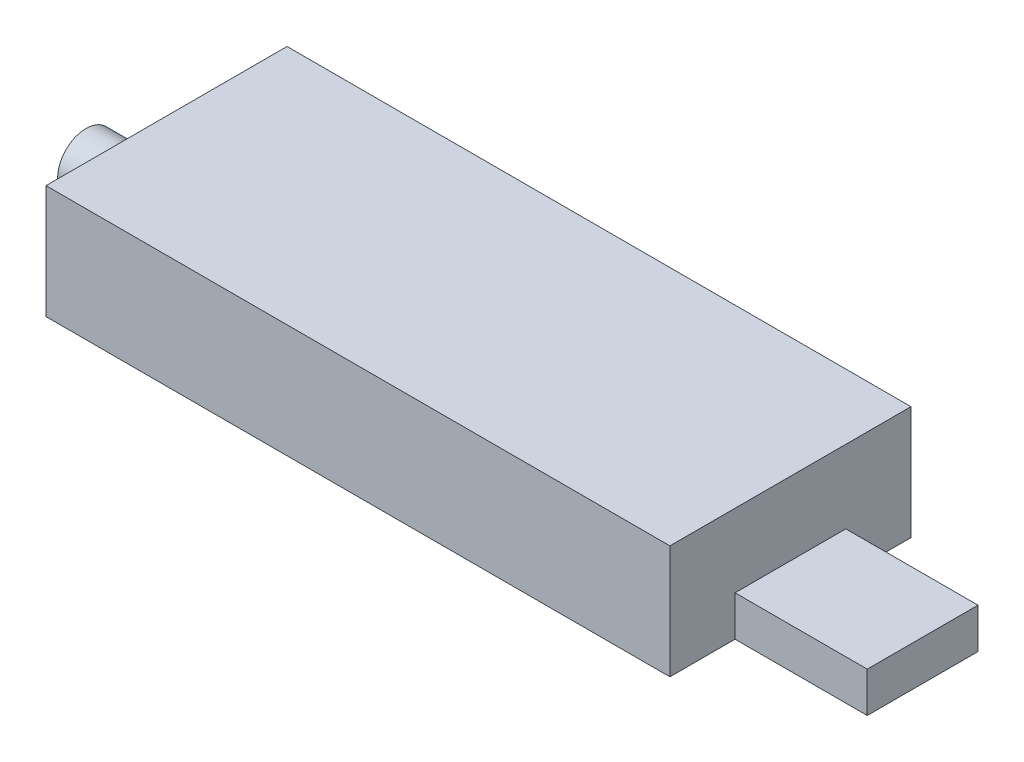
ISO-10303-21;
HEADER;
FILE_DESCRIPTION(('STEP AP214'),'2;1');
FILE_NAME('part.step','',(''),(''),'','','');
FILE_SCHEMA(('AUTOMOTIVE_DESIGN { 1 0 10303 214 1 1 1 1 }'));
ENDSEC;
DATA;
#1=APPLICATION_CONTEXT('core data for automotive mechanical design processes');
#2=APPLICATION_PROTOCOL_DEFINITION('international standard','automotive_design',2000,#1);
#3=PRODUCT_CONTEXT('',#1,'mechanical');
#4=PRODUCT('Part','Part','',(#3));
#5=PRODUCT_RELATED_PRODUCT_CATEGORY('part','',(#4));
#6=PRODUCT_DEFINITION_FORMATION('','',#4);
#7=PRODUCT_DEFINITION_CONTEXT('part definition',#1,'design');
#8=PRODUCT_DEFINITION('design','',#6,#7);
#9=PRODUCT_DEFINITION_SHAPE('','',#8);
#10=(LENGTH_UNIT() NAMED_UNIT(*) SI_UNIT(.MILLI.,.METRE.));
#11=(NAMED_UNIT(*) PLANE_ANGLE_UNIT() SI_UNIT($,.RADIAN.));
#12=(NAMED_UNIT(*) SI_UNIT($,.STERADIAN.) SOLID_ANGLE_UNIT());
#13=UNCERTAINTY_MEASURE_WITH_UNIT(LENGTH_MEASURE(1.E-05),#10,'distance_accuracy_value','');
#14=(GEOMETRIC_REPRESENTATION_CONTEXT(3) GLOBAL_UNCERTAINTY_ASSIGNED_CONTEXT((#13)) GLOBAL_UNIT_ASSIGNED_CONTEXT((#10,
#11,#12)) REPRESENTATION_CONTEXT('',''));
#15=CARTESIAN_POINT('',(0.,0.,0.));
#16=DIRECTION('',(0.,0.,1.));
#17=DIRECTION('',(1.,0.,0.));
#18=AXIS2_PLACEMENT_3D('',#15,#16,#17);
#19=CARTESIAN_POINT('',(69.85,12.7,0.));
#20=DIRECTION('',(-1.,0.,0.));
#21=DIRECTION('',(0.,0.,1.));
#22=AXIS2_PLACEMENT_3D('',#19,#20,#21);
#23=PLANE('',#22);
#24=DIRECTION('',(0.,-1.,0.));
#25=VECTOR('',#24,1.);
#26=CARTESIAN_POINT('',(69.85,0.,-7.29375));
#27=LINE('',#26,#25);
#28=CARTESIAN_POINT('',(69.85,4.5,-7.29375));
#29=VERTEX_POINT('',#28);
#30=CARTESIAN_POINT('',(69.85,0.,-7.29375));
#31=VERTEX_POINT('',#30);
#32=EDGE_CURVE('E51',#29,#31,#27,.T.);
#33=ORIENTED_EDGE('',*,*,#32,.F.);
#34=DIRECTION('',(0.,0.,1.));
#35=VECTOR('',#34,1.);
#36=CARTESIAN_POINT('',(69.85,4.5,-7.29375));
#37=LINE('',#36,#35);
#38=CARTESIAN_POINT('',(69.85,4.5,-19.69375));
#39=VERTEX_POINT('',#38);
#40=EDGE_CURVE('E121',#39,#29,#37,.T.);
#41=ORIENTED_EDGE('',*,*,#40,.F.);
#42=DIRECTION('',(0.,1.,0.));
#43=VECTOR('',#42,1.);
#44=CARTESIAN_POINT('',(69.85,0.,-19.69375));
#45=LINE('',#44,#43);
#46=CARTESIAN_POINT('',(69.85,0.,-19.69375));
#47=VERTEX_POINT('',#46);
#48=EDGE_CURVE('E57',#47,#39,#45,.T.);
#49=ORIENTED_EDGE('',*,*,#48,.F.);
#50=DIRECTION('',(0.,0.,-1.));
#51=VECTOR('',#50,1.);
#52=CARTESIAN_POINT('',(69.85,0.,0.));
#53=LINE('',#52,#51);
#54=CARTESIAN_POINT('',(69.85,0.,-26.9875));
#55=VERTEX_POINT('',#54);
#56=EDGE_CURVE('E145',#47,#55,#53,.T.);
#57=ORIENTED_EDGE('',*,*,#56,.T.);
#58=DIRECTION('',(0.,-1.,0.));
#59=VECTOR('',#58,1.);
#60=CARTESIAN_POINT('',(69.85,12.7,-26.9875));
#61=LINE('',#60,#59);
#62=CARTESIAN_POINT('',(69.85,12.7,-26.9875));
#63=VERTEX_POINT('',#62);
#64=EDGE_CURVE('E151',#63,#55,#61,.T.);
#65=ORIENTED_EDGE('',*,*,#64,.F.);
#66=DIRECTION('',(0.,0.,-1.));
#67=VECTOR('',#66,1.);
#68=CARTESIAN_POINT('',(69.85,12.7,0.));
#69=LINE('',#68,#67);
#70=CARTESIAN_POINT('',(69.85,12.7,0.));
#71=VERTEX_POINT('',#70);
#72=EDGE_CURVE('E139',#71,#63,#69,.T.);
#73=ORIENTED_EDGE('',*,*,#72,.F.);
#74=DIRECTION('',(0.,-1.,0.));
#75=VECTOR('',#74,1.);
#76=CARTESIAN_POINT('',(69.85,12.7,0.));
#77=LINE('',#76,#75);
#78=CARTESIAN_POINT('',(69.85,0.,0.));
#79=VERTEX_POINT('',#78);
#80=EDGE_CURVE('E154',#71,#79,#77,.T.);
#81=ORIENTED_EDGE('',*,*,#80,.T.);
#82=EDGE_CURVE('E146',#79,#31,#53,.T.);
#83=ORIENTED_EDGE('',*,*,#82,.T.);
#84=EDGE_LOOP('',(#33,#41,#49,#57,#65,#73,#81,#83));
#85=FACE_BOUND('',#84,.T.);
#86=ADVANCED_FACE('F36',(#85),#23,.F.);
#87=CARTESIAN_POINT('',(0.,12.7,0.));
#88=DIRECTION('',(1.,0.,0.));
#89=DIRECTION('',(0.,0.,-1.));
#90=AXIS2_PLACEMENT_3D('',#87,#88,#89);
#91=PLANE('',#90);
#92=CARTESIAN_POINT('',(0.,3.81,-13.49375));
#93=DIRECTION('',(1.,0.,0.));
#94=DIRECTION('',(0.,0.,-1.));
#95=AXIS2_PLACEMENT_3D('',#92,#93,#94);
#96=CIRCLE('',#95,3.175);
#97=CARTESIAN_POINT('',(0.,3.81,-16.66875));
#98=VERTEX_POINT('',#97);
#99=EDGE_CURVE('E11',#98,#98,#96,.F.);
#100=ORIENTED_EDGE('',*,*,#99,.F.);
#101=EDGE_LOOP('',(#100));
#102=FACE_BOUND('',#101,.T.);
#103=DIRECTION('',(0.,0.,1.));
#104=VECTOR('',#103,1.);
#105=CARTESIAN_POINT('',(0.,0.,0.));
#106=LINE('',#105,#104);
#107=CARTESIAN_POINT('',(0.,0.,-26.9875));
#108=VERTEX_POINT('',#107);
#109=CARTESIAN_POINT('',(0.,0.,0.));
#110=VERTEX_POINT('',#109);
#111=EDGE_CURVE('E124',#108,#110,#106,.T.);
#112=ORIENTED_EDGE('',*,*,#111,.T.);
#113=DIRECTION('',(0.,-1.,0.));
#114=VECTOR('',#113,1.);
#115=CARTESIAN_POINT('',(0.,12.7,0.));
#116=LINE('',#115,#114);
#117=CARTESIAN_POINT('',(0.,12.7,0.));
#118=VERTEX_POINT('',#117);
#119=EDGE_CURVE('E44',#118,#110,#116,.T.);
#120=ORIENTED_EDGE('',*,*,#119,.F.);
#121=DIRECTION('',(0.,0.,1.));
#122=VECTOR('',#121,1.);
#123=CARTESIAN_POINT('',(0.,12.7,0.));
#124=LINE('',#123,#122);
#125=CARTESIAN_POINT('',(0.,12.7,-26.9875));
#126=VERTEX_POINT('',#125);
#127=EDGE_CURVE('E133',#126,#118,#124,.T.);
#128=ORIENTED_EDGE('',*,*,#127,.F.);
#129=DIRECTION('',(0.,-1.,0.));
#130=VECTOR('',#129,1.);
#131=CARTESIAN_POINT('',(0.,12.7,-26.9875));
#132=LINE('',#131,#130);
#133=EDGE_CURVE('E142',#126,#108,#132,.T.);
#134=ORIENTED_EDGE('',*,*,#133,.T.);
#135=EDGE_LOOP('',(#112,#120,#128,#134));
#136=FACE_BOUND('',#135,.T.);
#137=ADVANCED_FACE('F38',(#102,#136),#91,.F.);
#138=CARTESIAN_POINT('',(0.,12.7,0.));
#139=DIRECTION('',(0.,0.,-1.));
#140=DIRECTION('',(-1.,0.,0.));
#141=AXIS2_PLACEMENT_3D('',#138,#139,#140);
#142=PLANE('',#141);
#143=DIRECTION('',(1.,0.,0.));
#144=VECTOR('',#143,1.);
#145=CARTESIAN_POINT('',(0.,0.,0.));
#146=LINE('',#145,#144);
#147=EDGE_CURVE('E127',#110,#79,#146,.T.);
#148=ORIENTED_EDGE('',*,*,#147,.T.);
#149=ORIENTED_EDGE('',*,*,#80,.F.);
#150=DIRECTION('',(1.,0.,0.));
#151=VECTOR('',#150,1.);
#152=CARTESIAN_POINT('',(0.,12.7,0.));
#153=LINE('',#152,#151);
#154=EDGE_CURVE('E136',#118,#71,#153,.T.);
#155=ORIENTED_EDGE('',*,*,#154,.F.);
#156=ORIENTED_EDGE('',*,*,#119,.T.);
#157=EDGE_LOOP('',(#148,#149,#155,#156));
#158=FACE_BOUND('',#157,.T.);
#159=ADVANCED_FACE('F159',(#158),#142,.F.);
#160=CARTESIAN_POINT('',(0.,12.7,-26.9875));
#161=DIRECTION('',(0.,0.,1.));
#162=DIRECTION('',(1.,0.,0.));
#163=AXIS2_PLACEMENT_3D('',#160,#161,#162);
#164=PLANE('',#163);
#165=DIRECTION('',(-1.,0.,0.));
#166=VECTOR('',#165,1.);
#167=CARTESIAN_POINT('',(0.,0.,-26.9875));
#168=LINE('',#167,#166);
#169=EDGE_CURVE('E137',#55,#108,#168,.T.);
#170=ORIENTED_EDGE('',*,*,#169,.T.);
#171=ORIENTED_EDGE('',*,*,#133,.F.);
#172=DIRECTION('',(-1.,0.,0.));
#173=VECTOR('',#172,1.);
#174=CARTESIAN_POINT('',(0.,12.7,-26.9875));
#175=LINE('',#174,#173);
#176=EDGE_CURVE('E141',#63,#126,#175,.T.);
#177=ORIENTED_EDGE('',*,*,#176,.F.);
#178=ORIENTED_EDGE('',*,*,#64,.T.);
#179=EDGE_LOOP('',(#170,#171,#177,#178));
#180=FACE_BOUND('',#179,.T.);
#181=ADVANCED_FACE('F171',(#180),#164,.F.);
#182=CARTESIAN_POINT('',(0.,12.7,0.));
#183=DIRECTION('',(0.,-1.,0.));
#184=DIRECTION('',(0.,0.,-1.));
#185=AXIS2_PLACEMENT_3D('',#182,#183,#184);
#186=PLANE('',#185);
#187=ORIENTED_EDGE('',*,*,#127,.T.);
#188=ORIENTED_EDGE('',*,*,#154,.T.);
#189=ORIENTED_EDGE('',*,*,#72,.T.);
#190=ORIENTED_EDGE('',*,*,#176,.T.);
#191=EDGE_LOOP('',(#187,#188,#189,#190));
#192=FACE_BOUND('',#191,.T.);
#193=ADVANCED_FACE('F169',(#192),#186,.F.);
#194=CARTESIAN_POINT('',(0.,0.,0.));
#195=DIRECTION('',(0.,-1.,0.));
#196=DIRECTION('',(0.,0.,-1.));
#197=AXIS2_PLACEMENT_3D('',#194,#195,#196);
#198=PLANE('',#197);
#199=ORIENTED_EDGE('',*,*,#111,.F.);
#200=ORIENTED_EDGE('',*,*,#169,.F.);
#201=ORIENTED_EDGE('',*,*,#56,.F.);
#202=DIRECTION('',(-1.,0.,0.));
#203=VECTOR('',#202,1.);
#204=CARTESIAN_POINT('',(84.65,0.,-19.69375));
#205=LINE('',#204,#203);
#206=CARTESIAN_POINT('',(84.65,0.,-19.69375));
#207=VERTEX_POINT('',#206);
#208=EDGE_CURVE('E108',#207,#47,#205,.T.);
#209=ORIENTED_EDGE('',*,*,#208,.F.);
#210=DIRECTION('',(0.,0.,-1.));
#211=VECTOR('',#210,1.);
#212=CARTESIAN_POINT('',(84.65,0.,-7.29375));
#213=LINE('',#212,#211);
#214=CARTESIAN_POINT('',(84.65,0.,-7.29375));
#215=VERTEX_POINT('',#214);
#216=EDGE_CURVE('E100',#215,#207,#213,.T.);
#217=ORIENTED_EDGE('',*,*,#216,.F.);
#218=DIRECTION('',(-1.,0.,0.));
#219=VECTOR('',#218,1.);
#220=CARTESIAN_POINT('',(84.65,0.,-7.29375));
#221=LINE('',#220,#219);
#222=EDGE_CURVE('E106',#215,#31,#221,.T.);
#223=ORIENTED_EDGE('',*,*,#222,.T.);
#224=ORIENTED_EDGE('',*,*,#82,.F.);
#225=ORIENTED_EDGE('',*,*,#147,.F.);
#226=EDGE_LOOP('',(#199,#200,#201,#209,#217,#223,#224,#225));
#227=FACE_BOUND('',#226,.T.);
#228=ADVANCED_FACE('F103',(#227),#198,.T.);
#229=CARTESIAN_POINT('',(84.65,0.,-7.29375));
#230=DIRECTION('',(0.,0.,-1.));
#231=DIRECTION('',(-1.,0.,0.));
#232=AXIS2_PLACEMENT_3D('',#229,#230,#231);
#233=PLANE('',#232);
#234=ORIENTED_EDGE('',*,*,#32,.T.);
#235=ORIENTED_EDGE('',*,*,#222,.F.);
#236=DIRECTION('',(0.,-1.,0.));
#237=VECTOR('',#236,1.);
#238=CARTESIAN_POINT('',(84.65,0.,-7.29375));
#239=LINE('',#238,#237);
#240=CARTESIAN_POINT('',(84.65,4.5,-7.29375));
#241=VERTEX_POINT('',#240);
#242=EDGE_CURVE('E112',#241,#215,#239,.T.);
#243=ORIENTED_EDGE('',*,*,#242,.F.);
#244=DIRECTION('',(-1.,0.,0.));
#245=VECTOR('',#244,1.);
#246=CARTESIAN_POINT('',(84.65,4.5,-7.29375));
#247=LINE('',#246,#245);
#248=EDGE_CURVE('E284',#241,#29,#247,.T.);
#249=ORIENTED_EDGE('',*,*,#248,.T.);
#250=EDGE_LOOP('',(#234,#235,#243,#249));
#251=FACE_BOUND('',#250,.T.);
#252=ADVANCED_FACE('F123',(#251),#233,.F.);
#253=CARTESIAN_POINT('',(84.65,0.,-19.69375));
#254=DIRECTION('',(0.,0.,1.));
#255=DIRECTION('',(0.,-1.,0.));
#256=AXIS2_PLACEMENT_3D('',#253,#254,#255);
#257=PLANE('',#256);
#258=ORIENTED_EDGE('',*,*,#48,.T.);
#259=DIRECTION('',(-1.,0.,0.));
#260=VECTOR('',#259,1.);
#261=CARTESIAN_POINT('',(84.65,4.5,-19.69375));
#262=LINE('',#261,#260);
#263=CARTESIAN_POINT('',(84.65,4.5,-19.69375));
#264=VERTEX_POINT('',#263);
#265=EDGE_CURVE('E129',#264,#39,#262,.T.);
#266=ORIENTED_EDGE('',*,*,#265,.F.);
#267=DIRECTION('',(0.,1.,0.));
#268=VECTOR('',#267,1.);
#269=CARTESIAN_POINT('',(84.65,0.,-19.69375));
#270=LINE('',#269,#268);
#271=EDGE_CURVE('E111',#207,#264,#270,.T.);
#272=ORIENTED_EDGE('',*,*,#271,.F.);
#273=ORIENTED_EDGE('',*,*,#208,.T.);
#274=EDGE_LOOP('',(#258,#266,#272,#273));
#275=FACE_BOUND('',#274,.T.);
#276=ADVANCED_FACE('F207',(#275),#257,.F.);
#277=CARTESIAN_POINT('',(84.65,4.5,-7.29375));
#278=DIRECTION('',(0.,-1.,0.));
#279=DIRECTION('',(0.,0.,-1.));
#280=AXIS2_PLACEMENT_3D('',#277,#278,#279);
#281=PLANE('',#280);
#282=ORIENTED_EDGE('',*,*,#40,.T.);
#283=ORIENTED_EDGE('',*,*,#248,.F.);
#284=DIRECTION('',(0.,0.,1.));
#285=VECTOR('',#284,1.);
#286=CARTESIAN_POINT('',(84.65,4.5,-7.29375));
#287=LINE('',#286,#285);
#288=EDGE_CURVE('E117',#264,#241,#287,.T.);
#289=ORIENTED_EDGE('',*,*,#288,.F.);
#290=ORIENTED_EDGE('',*,*,#265,.T.);
#291=EDGE_LOOP('',(#282,#283,#289,#290));
#292=FACE_BOUND('',#291,.T.);
#293=ADVANCED_FACE('F201',(#292),#281,.F.);
#294=CARTESIAN_POINT('',(84.65,0.,0.));
#295=DIRECTION('',(-1.,0.,0.));
#296=DIRECTION('',(0.,0.,1.));
#297=AXIS2_PLACEMENT_3D('',#294,#295,#296);
#298=PLANE('',#297);
#299=ORIENTED_EDGE('',*,*,#242,.T.);
#300=ORIENTED_EDGE('',*,*,#216,.T.);
#301=ORIENTED_EDGE('',*,*,#271,.T.);
#302=ORIENTED_EDGE('',*,*,#288,.T.);
#303=EDGE_LOOP('',(#299,#300,#301,#302));
#304=FACE_BOUND('',#303,.T.);
#305=ADVANCED_FACE('F115',(#304),#298,.F.);
#306=CARTESIAN_POINT('',(-17.9927561210691,3.81,-13.49375));
#307=DIRECTION('',(1.,0.,0.));
#308=DIRECTION('',(0.,0.,-1.));
#309=AXIS2_PLACEMENT_3D('',#306,#307,#308);
#310=CYLINDRICAL_SURFACE('',#309,3.175);
#311=CARTESIAN_POINT('',(-9.01249999999999,3.81,-13.49375));
#312=DIRECTION('',(1.,0.,0.));
#313=DIRECTION('',(0.,0.,-1.));
#314=AXIS2_PLACEMENT_3D('',#311,#312,#313);
#315=CIRCLE('',#314,3.175);
#316=CARTESIAN_POINT('',(-9.01249999999999,3.81,-16.66875));
#317=VERTEX_POINT('',#316);
#318=EDGE_CURVE('E289',#317,#317,#315,.T.);
#319=ORIENTED_EDGE('',*,*,#318,.T.);
#320=EDGE_LOOP('',(#319));
#321=FACE_BOUND('',#320,.T.);
#322=ORIENTED_EDGE('',*,*,#99,.T.);
#323=EDGE_LOOP('',(#322));
#324=FACE_BOUND('',#323,.T.);
#325=ADVANCED_FACE('F190',(#321,#324),#310,.T.);
#326=CARTESIAN_POINT('',(-9.01249999999999,0.,0.));
#327=DIRECTION('',(1.,0.,0.));
#328=DIRECTION('',(0.,0.,-1.));
#329=AXIS2_PLACEMENT_3D('',#326,#327,#328);
#330=PLANE('',#329);
#331=ORIENTED_EDGE('',*,*,#318,.F.);
#332=EDGE_LOOP('',(#331));
#333=FACE_BOUND('',#332,.T.);
#334=ADVANCED_FACE('F192',(#333),#330,.F.);
#335=CLOSED_SHELL('',(#86,#137,#159,#181,#193,#228,#252,#276,#293,#305,#325,#334));
#336=MANIFOLD_SOLID_BREP('B2',#335);
#337=ADVANCED_BREP_SHAPE_REPRESENTATION('',(#18,#336),#14);
#338=SHAPE_DEFINITION_REPRESENTATION(#9,#337);
ENDSEC;
END-ISO-10303-21;
